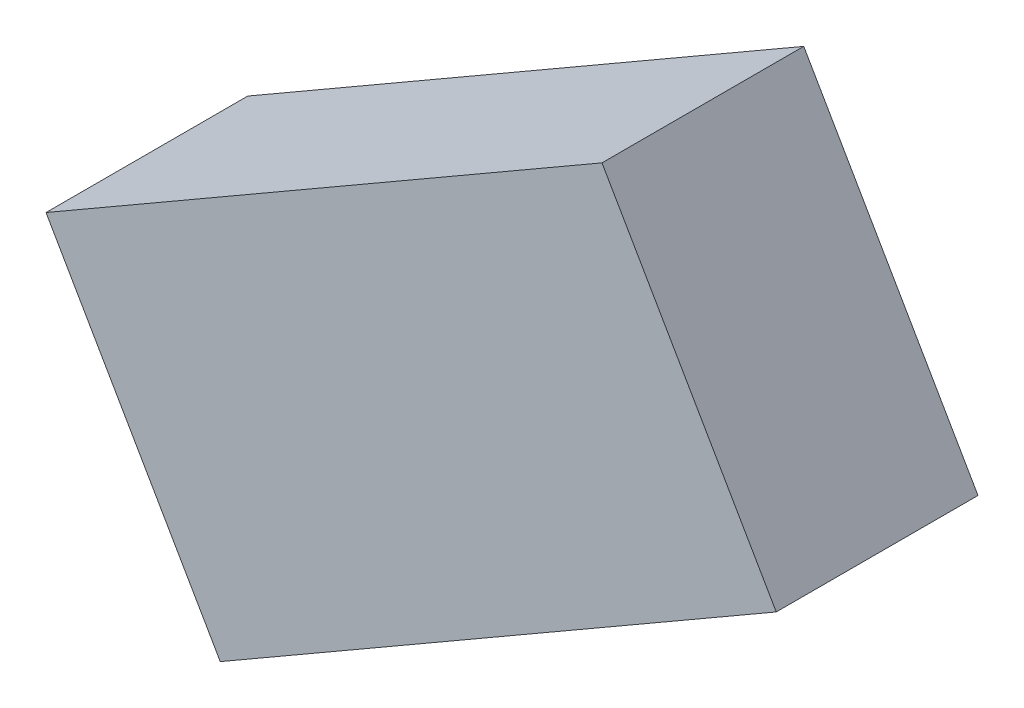
ISO-10303-21;
HEADER;
FILE_DESCRIPTION(('STEP AP214'),'2;1');
FILE_NAME('part.step','',(''),(''),'','','');
FILE_SCHEMA(('AUTOMOTIVE_DESIGN { 1 0 10303 214 1 1 1 1 }'));
ENDSEC;
DATA;
#1=APPLICATION_CONTEXT('core data for automotive mechanical design processes');
#2=APPLICATION_PROTOCOL_DEFINITION('international standard','automotive_design',2000,#1);
#3=PRODUCT_CONTEXT('',#1,'mechanical');
#4=PRODUCT('Part','Part','',(#3));
#5=PRODUCT_RELATED_PRODUCT_CATEGORY('part','',(#4));
#6=PRODUCT_DEFINITION_FORMATION('','',#4);
#7=PRODUCT_DEFINITION_CONTEXT('part definition',#1,'design');
#8=PRODUCT_DEFINITION('design','',#6,#7);
#9=PRODUCT_DEFINITION_SHAPE('','',#8);
#10=(LENGTH_UNIT() NAMED_UNIT(*) SI_UNIT(.MILLI.,.METRE.));
#11=(NAMED_UNIT(*) PLANE_ANGLE_UNIT() SI_UNIT($,.RADIAN.));
#12=(NAMED_UNIT(*) SI_UNIT($,.STERADIAN.) SOLID_ANGLE_UNIT());
#13=UNCERTAINTY_MEASURE_WITH_UNIT(LENGTH_MEASURE(1.E-05),#10,'distance_accuracy_value','');
#14=(GEOMETRIC_REPRESENTATION_CONTEXT(3) GLOBAL_UNCERTAINTY_ASSIGNED_CONTEXT((#13)) GLOBAL_UNIT_ASSIGNED_CONTEXT((#10,
#11,#12)) REPRESENTATION_CONTEXT('',''));
#15=CARTESIAN_POINT('',(0.,0.,0.));
#16=DIRECTION('',(0.,0.,1.));
#17=DIRECTION('',(1.,0.,0.));
#18=AXIS2_PLACEMENT_3D('',#15,#16,#17);
#19=CARTESIAN_POINT('',(-0.52027074,-0.84886038,0.5499989));
#20=DIRECTION('',(0.,0.,-1.));
#21=DIRECTION('',(-1.,0.,0.));
#22=AXIS2_PLACEMENT_3D('',#19,#20,#21);
#23=PLANE('',#22);
#24=DIRECTION('',(0.500002419059996,-0.866024007134994,0.));
#25=VECTOR('',#24,1.);
#26=CARTESIAN_POINT('',(0.9952736,0.02613914,0.5499989));
#27=LINE('',#26,#25);
#28=CARTESIAN_POINT('',(0.995273600000034,0.0261391399999409,0.5499989));
#29=VERTEX_POINT('',#28);
#30=CARTESIAN_POINT('',(0.520270739999913,0.84886291999995,0.5499989));
#31=VERTEX_POINT('',#30);
#32=EDGE_CURVE('E55',#29,#31,#27,.F.);
#33=ORIENTED_EDGE('',*,*,#32,.T.);
#34=DIRECTION('',(0.866024514547113,0.500001540201065,0.));
#35=VECTOR('',#34,1.);
#36=CARTESIAN_POINT('',(0.52027074,0.84886292,0.5499989));
#37=LINE('',#36,#35);
#38=CARTESIAN_POINT('',(-0.995271060000016,-0.0261391399999719,0.5499989));
#39=VERTEX_POINT('',#38);
#40=EDGE_CURVE('E57',#31,#39,#37,.F.);
#41=ORIENTED_EDGE('',*,*,#40,.T.);
#42=DIRECTION('',(-0.500001571544081,0.866024496451139,0.));
#43=VECTOR('',#42,1.);
#44=CARTESIAN_POINT('',(-0.99527106,-0.02613914,0.5499989));
#45=LINE('',#44,#43);
#46=CARTESIAN_POINT('',(-0.520270739999755,-0.848860379999859,0.5499989));
#47=VERTEX_POINT('',#46);
#48=EDGE_CURVE('E20',#39,#47,#45,.F.);
#49=ORIENTED_EDGE('',*,*,#48,.T.);
#50=DIRECTION('',(-0.866025505893321,-0.499999823142186,0.));
#51=VECTOR('',#50,1.);
#52=CARTESIAN_POINT('',(-0.52027074,-0.84886038,0.5499989));
#53=LINE('',#52,#51);
#54=EDGE_CURVE('E80',#47,#29,#53,.F.);
#55=ORIENTED_EDGE('',*,*,#54,.T.);
#56=EDGE_LOOP('',(#33,#41,#49,#55));
#57=FACE_BOUND('',#56,.T.);
#58=ADVANCED_FACE('F17',(#57),#23,.F.);
#59=CARTESIAN_POINT('',(-0.99527106,-0.02613914,0.));
#60=DIRECTION('',(0.866024496451139,0.500001571544081,0.));
#61=DIRECTION('',(-0.500001571544081,0.866024496451139,0.));
#62=AXIS2_PLACEMENT_3D('',#59,#60,#61);
#63=PLANE('',#62);
#64=DIRECTION('',(0.,0.,1.));
#65=VECTOR('',#64,1.);
#66=CARTESIAN_POINT('',(-0.52027074,-0.84886038,0.));
#67=LINE('',#66,#65);
#68=CARTESIAN_POINT('',(-0.520270739999755,-0.848860379999859,0.));
#69=VERTEX_POINT('',#68);
#70=EDGE_CURVE('E68',#69,#47,#67,.T.);
#71=ORIENTED_EDGE('',*,*,#70,.T.);
#72=ORIENTED_EDGE('',*,*,#48,.F.);
#73=DIRECTION('',(0.,0.,1.));
#74=VECTOR('',#73,1.);
#75=CARTESIAN_POINT('',(-0.995271060000065,-0.0261391399998881,0.));
#76=LINE('',#75,#74);
#77=CARTESIAN_POINT('',(-0.995271060000016,-0.026139139999972,0.));
#78=VERTEX_POINT('',#77);
#79=EDGE_CURVE('E63',#39,#78,#76,.F.);
#80=ORIENTED_EDGE('',*,*,#79,.T.);
#81=DIRECTION('',(-0.500001571543566,0.866024496451437,0.));
#82=VECTOR('',#81,1.);
#83=CARTESIAN_POINT('',(-0.52027074,-0.84886038,0.));
#84=LINE('',#83,#82);
#85=EDGE_CURVE('E83',#69,#78,#84,.T.);
#86=ORIENTED_EDGE('',*,*,#85,.F.);
#87=EDGE_LOOP('',(#71,#72,#80,#86));
#88=FACE_BOUND('',#87,.T.);
#89=ADVANCED_FACE('F65',(#88),#63,.F.);
#90=CARTESIAN_POINT('',(0.52027074,0.84886292,0.));
#91=DIRECTION('',(0.500001540201065,-0.866024514547113,0.));
#92=DIRECTION('',(0.866024514547113,0.500001540201065,0.));
#93=AXIS2_PLACEMENT_3D('',#90,#91,#92);
#94=PLANE('',#93);
#95=ORIENTED_EDGE('',*,*,#79,.F.);
#96=ORIENTED_EDGE('',*,*,#40,.F.);
#97=DIRECTION('',(0.,0.,1.));
#98=VECTOR('',#97,1.);
#99=CARTESIAN_POINT('',(0.520270739999652,0.848862919999799,0.));
#100=LINE('',#99,#98);
#101=CARTESIAN_POINT('',(0.520270739999913,0.84886291999995,0.));
#102=VERTEX_POINT('',#101);
#103=EDGE_CURVE('E75',#31,#102,#100,.F.);
#104=ORIENTED_EDGE('',*,*,#103,.T.);
#105=DIRECTION('',(0.866024514547076,0.500001540201129,0.));
#106=VECTOR('',#105,1.);
#107=CARTESIAN_POINT('',(-0.99527106,-0.02613914,0.));
#108=LINE('',#107,#106);
#109=EDGE_CURVE('E72',#78,#102,#108,.T.);
#110=ORIENTED_EDGE('',*,*,#109,.F.);
#111=EDGE_LOOP('',(#95,#96,#104,#110));
#112=FACE_BOUND('',#111,.T.);
#113=ADVANCED_FACE('F70',(#112),#94,.F.);
#114=CARTESIAN_POINT('',(0.9952736,0.02613914,0.));
#115=DIRECTION('',(-0.866024007134994,-0.500002419059996,0.));
#116=DIRECTION('',(0.500002419059996,-0.866024007134994,0.));
#117=AXIS2_PLACEMENT_3D('',#114,#115,#116);
#118=PLANE('',#117);
#119=ORIENTED_EDGE('',*,*,#103,.F.);
#120=ORIENTED_EDGE('',*,*,#32,.F.);
#121=DIRECTION('',(0.,0.,1.));
#122=VECTOR('',#121,1.);
#123=CARTESIAN_POINT('',(0.995273600000136,0.0261391399997636,0.));
#124=LINE('',#123,#122);
#125=CARTESIAN_POINT('',(0.995273600000034,0.0261391399999409,0.));
#126=VERTEX_POINT('',#125);
#127=EDGE_CURVE('E35',#29,#126,#124,.F.);
#128=ORIENTED_EDGE('',*,*,#127,.T.);
#129=DIRECTION('',(0.50000241905963,-0.866024007135205,0.));
#130=VECTOR('',#129,1.);
#131=CARTESIAN_POINT('',(0.52027074,0.84886292,0.));
#132=LINE('',#131,#130);
#133=EDGE_CURVE('E26',#102,#126,#132,.T.);
#134=ORIENTED_EDGE('',*,*,#133,.F.);
#135=EDGE_LOOP('',(#119,#120,#128,#134));
#136=FACE_BOUND('',#135,.T.);
#137=ADVANCED_FACE('F89',(#136),#118,.F.);
#138=CARTESIAN_POINT('',(-0.52027074,-0.84886038,0.));
#139=DIRECTION('',(-0.499999823142186,0.866025505893321,0.));
#140=DIRECTION('',(-0.866025505893321,-0.499999823142186,0.));
#141=AXIS2_PLACEMENT_3D('',#138,#139,#140);
#142=PLANE('',#141);
#143=ORIENTED_EDGE('',*,*,#127,.F.);
#144=ORIENTED_EDGE('',*,*,#54,.F.);
#145=ORIENTED_EDGE('',*,*,#70,.F.);
#146=DIRECTION('',(-0.866025505893243,-0.499999823142321,0.));
#147=VECTOR('',#146,1.);
#148=CARTESIAN_POINT('',(0.9952736,0.02613914,0.));
#149=LINE('',#148,#147);
#150=EDGE_CURVE('E11',#126,#69,#149,.T.);
#151=ORIENTED_EDGE('',*,*,#150,.F.);
#152=EDGE_LOOP('',(#143,#144,#145,#151));
#153=FACE_BOUND('',#152,.T.);
#154=ADVANCED_FACE('F91',(#153),#142,.F.);
#155=CARTESIAN_POINT('',(-0.52027074,-0.84886038,0.));
#156=DIRECTION('',(0.,0.,-1.));
#157=DIRECTION('',(-1.,0.,0.));
#158=AXIS2_PLACEMENT_3D('',#155,#156,#157);
#159=PLANE('',#158);
#160=ORIENTED_EDGE('',*,*,#133,.T.);
#161=ORIENTED_EDGE('',*,*,#150,.T.);
#162=ORIENTED_EDGE('',*,*,#85,.T.);
#163=ORIENTED_EDGE('',*,*,#109,.T.);
#164=EDGE_LOOP('',(#160,#161,#162,#163));
#165=FACE_BOUND('',#164,.T.);
#166=ADVANCED_FACE('F88',(#165),#159,.T.);
#167=CLOSED_SHELL('',(#58,#89,#113,#137,#154,#166));
#168=MANIFOLD_SOLID_BREP('B1',#167);
#169=ADVANCED_BREP_SHAPE_REPRESENTATION('',(#18,#168),#14);
#170=SHAPE_DEFINITION_REPRESENTATION(#9,#169);
ENDSEC;
END-ISO-10303-21;
